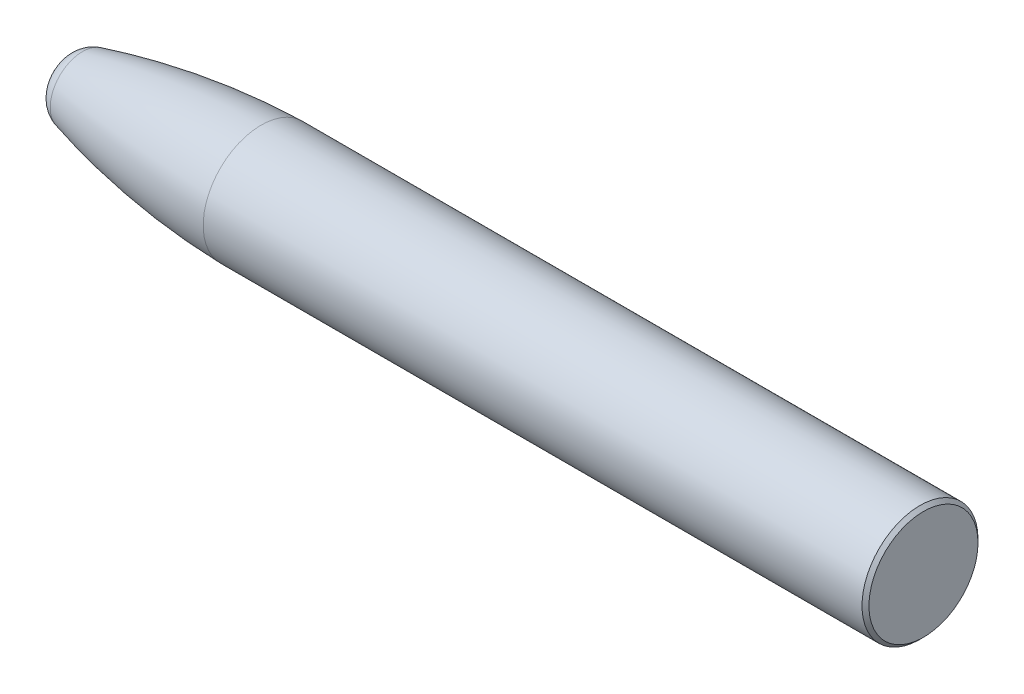
ISO-10303-21;
HEADER;
FILE_DESCRIPTION(('STEP AP214'),'2;1');
FILE_NAME('part.step','',(''),(''),'','','');
FILE_SCHEMA(('AUTOMOTIVE_DESIGN { 1 0 10303 214 1 1 1 1 }'));
ENDSEC;
DATA;
#1=APPLICATION_CONTEXT('core data for automotive mechanical design processes');
#2=APPLICATION_PROTOCOL_DEFINITION('international standard','automotive_design',2000,#1);
#3=PRODUCT_CONTEXT('',#1,'mechanical');
#4=PRODUCT('Part','Part','',(#3));
#5=PRODUCT_RELATED_PRODUCT_CATEGORY('part','',(#4));
#6=PRODUCT_DEFINITION_FORMATION('','',#4);
#7=PRODUCT_DEFINITION_CONTEXT('part definition',#1,'design');
#8=PRODUCT_DEFINITION('design','',#6,#7);
#9=PRODUCT_DEFINITION_SHAPE('','',#8);
#10=(LENGTH_UNIT() NAMED_UNIT(*) SI_UNIT(.MILLI.,.METRE.));
#11=(NAMED_UNIT(*) PLANE_ANGLE_UNIT() SI_UNIT($,.RADIAN.));
#12=(NAMED_UNIT(*) SI_UNIT($,.STERADIAN.) SOLID_ANGLE_UNIT());
#13=UNCERTAINTY_MEASURE_WITH_UNIT(LENGTH_MEASURE(1.E-05),#10,'distance_accuracy_value','');
#14=(GEOMETRIC_REPRESENTATION_CONTEXT(3) GLOBAL_UNCERTAINTY_ASSIGNED_CONTEXT((#13)) GLOBAL_UNIT_ASSIGNED_CONTEXT((#10,
#11,#12)) REPRESENTATION_CONTEXT('',''));
#15=CARTESIAN_POINT('',(0.,0.,0.));
#16=DIRECTION('',(0.,0.,1.));
#17=DIRECTION('',(1.,0.,0.));
#18=AXIS2_PLACEMENT_3D('',#15,#16,#17);
#19=CARTESIAN_POINT('',(29.337,3.73092408513661,0.));
#20=DIRECTION('',(1.,0.,0.));
#21=DIRECTION('',(0.,0.,-1.));
#22=AXIS2_PLACEMENT_3D('',#19,#20,#21);
#23=PLANE('',#22);
#24=CARTESIAN_POINT('',(29.337,0.,0.));
#25=DIRECTION('',(1.,0.,0.));
#26=DIRECTION('',(0.,0.,-1.));
#27=AXIS2_PLACEMENT_3D('',#24,#25,#26);
#28=CIRCLE('',#27,3.73092408513661);
#29=CARTESIAN_POINT('',(29.337,0.,-3.73092408513661));
#30=VERTEX_POINT('',#29);
#31=EDGE_CURVE('E10',#30,#30,#28,.T.);
#32=ORIENTED_EDGE('',*,*,#31,.T.);
#33=EDGE_LOOP('',(#32));
#34=FACE_BOUND('',#33,.T.);
#35=ADVANCED_FACE('F14',(#34),#23,.T.);
#36=CARTESIAN_POINT('',(29.337,0.,0.));
#37=DIRECTION('',(-1.,0.,0.));
#38=DIRECTION('',(0.,0.,1.));
#39=AXIS2_PLACEMENT_3D('',#36,#37,#38);
#40=CONICAL_SURFACE('',#39,3.73092408513661,0.785398163397453);
#41=CARTESIAN_POINT('',(29.0991740851366,0.,0.));
#42=DIRECTION('',(1.,0.,0.));
#43=DIRECTION('',(0.,0.,-1.));
#44=AXIS2_PLACEMENT_3D('',#41,#42,#43);
#45=CIRCLE('',#44,3.96875000000001);
#46=CARTESIAN_POINT('',(29.0991740851366,0.,-3.96875000000001));
#47=VERTEX_POINT('',#46);
#48=EDGE_CURVE('E20',#47,#47,#45,.T.);
#49=ORIENTED_EDGE('',*,*,#48,.T.);
#50=EDGE_LOOP('',(#49));
#51=FACE_BOUND('',#50,.T.);
#52=ORIENTED_EDGE('',*,*,#31,.F.);
#53=EDGE_LOOP('',(#52));
#54=FACE_BOUND('',#53,.T.);
#55=ADVANCED_FACE('F51',(#51,#54),#40,.T.);
#56=CARTESIAN_POINT('',(62.3695410292072,0.,0.));
#57=DIRECTION('',(1.,0.,0.));
#58=DIRECTION('',(0.,0.,-1.));
#59=AXIS2_PLACEMENT_3D('',#56,#57,#58);
#60=CYLINDRICAL_SURFACE('',#59,3.96875);
#61=CARTESIAN_POINT('',(-15.9806510284684,0.,0.));
#62=DIRECTION('',(1.,0.,0.));
#63=DIRECTION('',(0.,0.,-1.));
#64=AXIS2_PLACEMENT_3D('',#61,#62,#63);
#65=CIRCLE('',#64,3.96875);
#66=CARTESIAN_POINT('',(-15.9806510284684,0.,-3.96875));
#67=VERTEX_POINT('',#66);
#68=EDGE_CURVE('E24',#67,#67,#65,.T.);
#69=ORIENTED_EDGE('',*,*,#68,.T.);
#70=EDGE_LOOP('',(#69));
#71=FACE_BOUND('',#70,.T.);
#72=ORIENTED_EDGE('',*,*,#48,.F.);
#73=EDGE_LOOP('',(#72));
#74=FACE_BOUND('',#73,.T.);
#75=ADVANCED_FACE('F56',(#71,#74),#60,.T.);
#76=CARTESIAN_POINT('',(-14.7360925361703,0.,0.));
#77=DIRECTION('',(1.,0.,0.));
#78=DIRECTION('',(0.,0.,-1.));
#79=AXIS2_PLACEMENT_3D('',#76,#77,#78);
#80=DEGENERATE_TOROIDAL_SURFACE('',#79,48.0250569420547,52.0087001007371,.F.);
#81=CARTESIAN_POINT('',(-28.2077598882155,0.,0.));
#82=DIRECTION('',(1.,0.,0.));
#83=DIRECTION('',(0.,0.,-1.));
#84=AXIS2_PLACEMENT_3D('',#81,#82,#83);
#85=CIRCLE('',#84,2.20858780849319);
#86=CARTESIAN_POINT('',(-28.2077598882155,0.,-2.20858780849319));
#87=VERTEX_POINT('',#86);
#88=EDGE_CURVE('E28',#87,#87,#85,.T.);
#89=ORIENTED_EDGE('',*,*,#88,.T.);
#90=EDGE_LOOP('',(#89));
#91=FACE_BOUND('',#90,.T.);
#92=ORIENTED_EDGE('',*,*,#68,.F.);
#93=EDGE_LOOP('',(#92));
#94=FACE_BOUND('',#93,.T.);
#95=ADVANCED_FACE('F48',(#91,#94),#80,.F.);
#96=CARTESIAN_POINT('',(-27.8130033109317,0.,0.));
#97=DIRECTION('',(1.,0.,0.));
#98=DIRECTION('',(0.,0.,-1.));
#99=AXIS2_PLACEMENT_3D('',#96,#97,#98);
#100=DEGENERATE_TOROIDAL_SURFACE('',#99,0.736605080000001,1.52399668906829,.T.);
#101=CARTESIAN_POINT('',(-29.337,0.,0.));
#102=DIRECTION('',(1.,0.,0.));
#103=DIRECTION('',(0.,0.,-1.));
#104=AXIS2_PLACEMENT_3D('',#101,#102,#103);
#105=CIRCLE('',#104,0.736605080000001);
#106=CARTESIAN_POINT('',(-29.337,0.,-0.736605080000001));
#107=VERTEX_POINT('',#106);
#108=EDGE_CURVE('E33',#107,#107,#105,.T.);
#109=ORIENTED_EDGE('',*,*,#108,.T.);
#110=EDGE_LOOP('',(#109));
#111=FACE_BOUND('',#110,.T.);
#112=ORIENTED_EDGE('',*,*,#88,.F.);
#113=EDGE_LOOP('',(#112));
#114=FACE_BOUND('',#113,.T.);
#115=ADVANCED_FACE('F37',(#111,#114),#100,.T.);
#116=CARTESIAN_POINT('',(-29.337,0.736605080000001,0.));
#117=DIRECTION('',(-1.,0.,0.));
#118=DIRECTION('',(0.,0.,1.));
#119=AXIS2_PLACEMENT_3D('',#116,#117,#118);
#120=PLANE('',#119);
#121=ORIENTED_EDGE('',*,*,#108,.F.);
#122=EDGE_LOOP('',(#121));
#123=FACE_BOUND('',#122,.T.);
#124=ADVANCED_FACE('F40',(#123),#120,.T.);
#125=CLOSED_SHELL('',(#35,#55,#75,#95,#115,#124));
#126=MANIFOLD_SOLID_BREP('B1',#125);
#127=ADVANCED_BREP_SHAPE_REPRESENTATION('',(#18,#126),#14);
#128=SHAPE_DEFINITION_REPRESENTATION(#9,#127);
ENDSEC;
END-ISO-10303-21;
